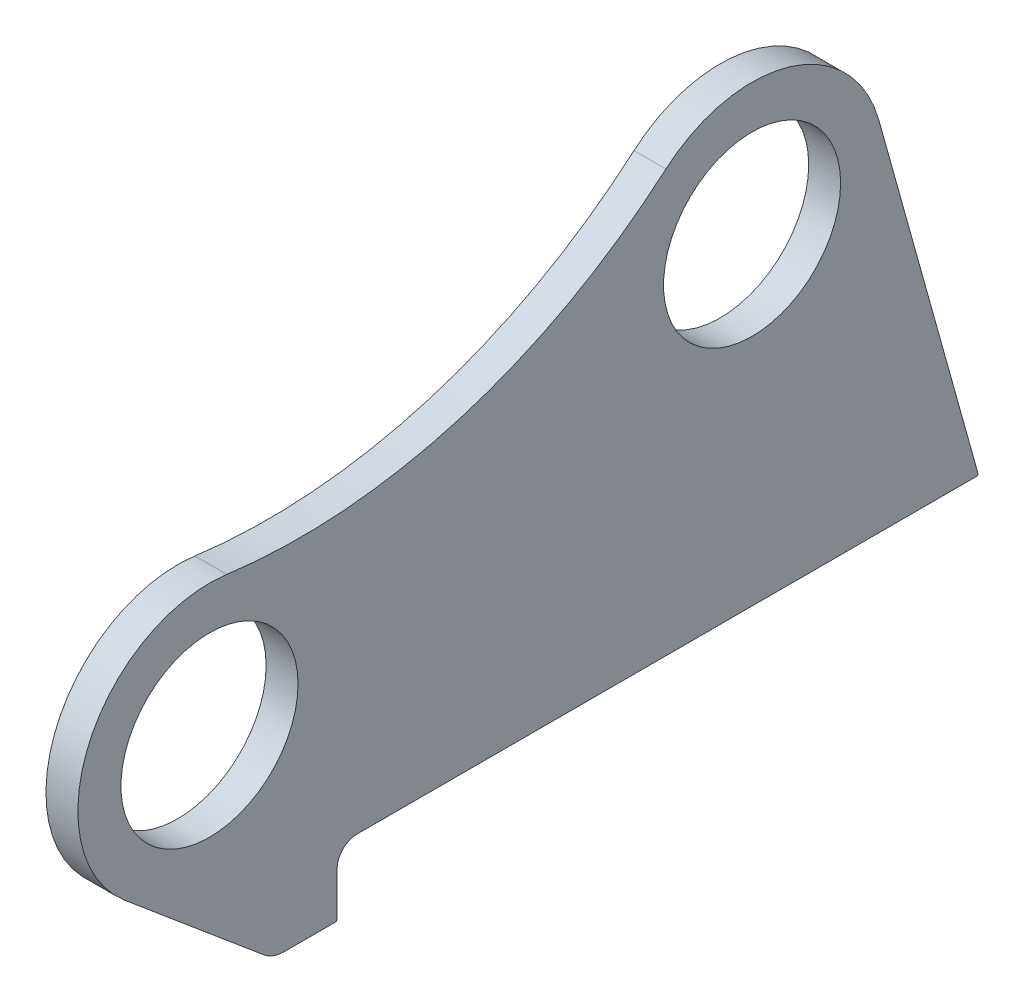
ISO-10303-21;
HEADER;
FILE_DESCRIPTION(('STEP AP214'),'2;1');
FILE_NAME('part.step','',(''),(''),'','','');
FILE_SCHEMA(('AUTOMOTIVE_DESIGN { 1 0 10303 214 1 1 1 1 }'));
ENDSEC;
DATA;
#1=APPLICATION_CONTEXT('core data for automotive mechanical design processes');
#2=APPLICATION_PROTOCOL_DEFINITION('international standard','automotive_design',2000,#1);
#3=PRODUCT_CONTEXT('',#1,'mechanical');
#4=PRODUCT('Part','Part','',(#3));
#5=PRODUCT_RELATED_PRODUCT_CATEGORY('part','',(#4));
#6=PRODUCT_DEFINITION_FORMATION('','',#4);
#7=PRODUCT_DEFINITION_CONTEXT('part definition',#1,'design');
#8=PRODUCT_DEFINITION('design','',#6,#7);
#9=PRODUCT_DEFINITION_SHAPE('','',#8);
#10=(LENGTH_UNIT() NAMED_UNIT(*) SI_UNIT(.MILLI.,.METRE.));
#11=(NAMED_UNIT(*) PLANE_ANGLE_UNIT() SI_UNIT($,.RADIAN.));
#12=(NAMED_UNIT(*) SI_UNIT($,.STERADIAN.) SOLID_ANGLE_UNIT());
#13=UNCERTAINTY_MEASURE_WITH_UNIT(LENGTH_MEASURE(1.E-05),#10,'distance_accuracy_value','');
#14=(GEOMETRIC_REPRESENTATION_CONTEXT(3) GLOBAL_UNCERTAINTY_ASSIGNED_CONTEXT((#13)) GLOBAL_UNIT_ASSIGNED_CONTEXT((#10,
#11,#12)) REPRESENTATION_CONTEXT('',''));
#15=CARTESIAN_POINT('',(0.,0.,0.));
#16=DIRECTION('',(0.,0.,1.));
#17=DIRECTION('',(1.,0.,0.));
#18=AXIS2_PLACEMENT_3D('',#15,#16,#17);
#19=CARTESIAN_POINT('',(-20.,528.745227809778,23.1336687455192));
#20=DIRECTION('',(1.,0.,0.));
#21=DIRECTION('',(0.,0.,-1.));
#22=AXIS2_PLACEMENT_3D('',#19,#20,#21);
#23=CYLINDRICAL_SURFACE('',#22,350.);
#24=CARTESIAN_POINT('',(0.,528.745227809778,23.1336687455192));
#25=DIRECTION('',(-1.,0.,0.));
#26=DIRECTION('',(0.,0.,-1.));
#27=AXIS2_PLACEMENT_3D('',#24,#25,#26);
#28=CIRCLE('',#27,350.);
#29=CARTESIAN_POINT('',(0.,264.217399055742,-206.049724663941));
#30=VERTEX_POINT('',#29);
#31=CARTESIAN_POINT('',(0.,181.783771778747,69.1526651364285));
#32=VERTEX_POINT('',#31);
#33=EDGE_CURVE('E178',#30,#32,#28,.T.);
#34=ORIENTED_EDGE('',*,*,#33,.F.);
#35=DIRECTION('',(1.,0.,0.));
#36=VECTOR('',#35,1.);
#37=CARTESIAN_POINT('',(-20.,264.217399055742,-206.049724663941));
#38=LINE('',#37,#36);
#39=CARTESIAN_POINT('',(-20.,264.217399055742,-206.049724663941));
#40=VERTEX_POINT('',#39);
#41=EDGE_CURVE('E151',#40,#30,#38,.T.);
#42=ORIENTED_EDGE('',*,*,#41,.F.);
#43=CARTESIAN_POINT('',(-20.,528.745227809778,23.1336687455192));
#44=DIRECTION('',(-1.,0.,0.));
#45=DIRECTION('',(0.,0.,-1.));
#46=AXIS2_PLACEMENT_3D('',#43,#44,#45);
#47=CIRCLE('',#46,350.);
#48=CARTESIAN_POINT('',(-20.,181.783771778747,69.1526651364285));
#49=VERTEX_POINT('',#48);
#50=EDGE_CURVE('E145',#40,#49,#47,.T.);
#51=ORIENTED_EDGE('',*,*,#50,.T.);
#52=DIRECTION('',(1.,0.,0.));
#53=VECTOR('',#52,1.);
#54=CARTESIAN_POINT('',(-20.,181.783771778747,69.1526651364285));
#55=LINE('',#54,#53);
#56=EDGE_CURVE('E127',#49,#32,#55,.T.);
#57=ORIENTED_EDGE('',*,*,#56,.T.);
#58=EDGE_LOOP('',(#34,#42,#51,#57));
#59=FACE_BOUND('',#58,.T.);
#60=ADVANCED_FACE('F38',(#59),#23,.F.);
#61=CARTESIAN_POINT('',(-20.,201.864410849434,-260.071524539028));
#62=DIRECTION('',(1.,0.,0.));
#63=DIRECTION('',(0.,0.,-1.));
#64=AXIS2_PLACEMENT_3D('',#61,#62,#63);
#65=CYLINDRICAL_SURFACE('',#64,82.5);
#66=CARTESIAN_POINT('',(0.,201.864410849434,-260.071524539028));
#67=DIRECTION('',(1.,0.,0.));
#68=DIRECTION('',(0.,0.,-1.));
#69=AXIS2_PLACEMENT_3D('',#66,#67,#68);
#70=CIRCLE('',#69,82.5);
#71=CARTESIAN_POINT('',(0.,224.021204370391,-339.5405531028));
#72=VERTEX_POINT('',#71);
#73=EDGE_CURVE('E152',#72,#30,#70,.T.);
#74=ORIENTED_EDGE('',*,*,#73,.F.);
#75=DIRECTION('',(1.,0.,0.));
#76=VECTOR('',#75,1.);
#77=CARTESIAN_POINT('',(-20.,224.021204370391,-339.5405531028));
#78=LINE('',#77,#76);
#79=CARTESIAN_POINT('',(-20.,224.021204370391,-339.5405531028));
#80=VERTEX_POINT('',#79);
#81=EDGE_CURVE('E202',#80,#72,#78,.T.);
#82=ORIENTED_EDGE('',*,*,#81,.F.);
#83=CARTESIAN_POINT('',(-20.,201.864410849434,-260.071524539028));
#84=DIRECTION('',(1.,0.,0.));
#85=DIRECTION('',(0.,0.,-1.));
#86=AXIS2_PLACEMENT_3D('',#83,#84,#85);
#87=CIRCLE('',#86,82.5);
#88=EDGE_CURVE('E138',#80,#40,#87,.T.);
#89=ORIENTED_EDGE('',*,*,#88,.T.);
#90=ORIENTED_EDGE('',*,*,#41,.T.);
#91=EDGE_LOOP('',(#74,#82,#89,#90));
#92=FACE_BOUND('',#91,.T.);
#93=ADVANCED_FACE('F243',(#92),#65,.T.);
#94=CARTESIAN_POINT('',(-20.,0.,-402.));
#95=DIRECTION('',(0.,0.268567194193426,-0.963260952288149));
#96=DIRECTION('',(0.,0.963260952288149,0.268567194193426));
#97=AXIS2_PLACEMENT_3D('',#94,#95,#96);
#98=PLANE('',#97);
#99=DIRECTION('',(0.,0.963260952288149,0.268567194193426));
#100=VECTOR('',#99,1.);
#101=CARTESIAN_POINT('',(0.,0.,-402.));
#102=LINE('',#101,#100);
#103=CARTESIAN_POINT('',(0.,1.26856719419344,-401.646310243158));
#104=VERTEX_POINT('',#103);
#105=EDGE_CURVE('E155',#104,#72,#102,.T.);
#106=ORIENTED_EDGE('',*,*,#105,.F.);
#107=DIRECTION('',(1.,0.,0.));
#108=VECTOR('',#107,1.);
#109=CARTESIAN_POINT('',(-20.,1.26856719419344,-401.646310243158));
#110=LINE('',#109,#108);
#111=CARTESIAN_POINT('',(-20.,1.26856719419344,-401.646310243158));
#112=VERTEX_POINT('',#111);
#113=EDGE_CURVE('E221',#104,#112,#110,.F.);
#114=ORIENTED_EDGE('',*,*,#113,.T.);
#115=DIRECTION('',(0.,0.963260952288149,0.268567194193426));
#116=VECTOR('',#115,1.);
#117=CARTESIAN_POINT('',(-20.,0.,-402.));
#118=LINE('',#117,#116);
#119=EDGE_CURVE('E175',#112,#80,#118,.T.);
#120=ORIENTED_EDGE('',*,*,#119,.T.);
#121=ORIENTED_EDGE('',*,*,#81,.T.);
#122=EDGE_LOOP('',(#106,#114,#120,#121));
#123=FACE_BOUND('',#122,.T.);
#124=ADVANCED_FACE('F269',(#123),#98,.T.);
#125=CARTESIAN_POINT('',(-20.,0.,-12.5));
#126=DIRECTION('',(0.,-1.,0.));
#127=DIRECTION('',(0.,0.,-1.));
#128=AXIS2_PLACEMENT_3D('',#125,#126,#127);
#129=PLANE('',#128);
#130=DIRECTION('',(0.,0.,-1.));
#131=VECTOR('',#130,1.);
#132=CARTESIAN_POINT('',(-20.,0.,-12.5));
#133=LINE('',#132,#131);
#134=CARTESIAN_POINT('',(-20.,0.,-12.5));
#135=VERTEX_POINT('',#134);
#136=CARTESIAN_POINT('',(-20.,0.,-400.68304929087));
#137=VERTEX_POINT('',#136);
#138=EDGE_CURVE('E172',#135,#137,#133,.T.);
#139=ORIENTED_EDGE('',*,*,#138,.T.);
#140=DIRECTION('',(1.,0.,0.));
#141=VECTOR('',#140,1.);
#142=CARTESIAN_POINT('',(-20.,0.,-400.68304929087));
#143=LINE('',#142,#141);
#144=CARTESIAN_POINT('',(0.,0.,-400.68304929087));
#145=VERTEX_POINT('',#144);
#146=EDGE_CURVE('E201',#137,#145,#143,.T.);
#147=ORIENTED_EDGE('',*,*,#146,.T.);
#148=DIRECTION('',(0.,0.,-1.));
#149=VECTOR('',#148,1.);
#150=CARTESIAN_POINT('',(0.,0.,-12.5));
#151=LINE('',#150,#149);
#152=CARTESIAN_POINT('',(0.,0.,-12.5));
#153=VERTEX_POINT('',#152);
#154=EDGE_CURVE('E196',#153,#145,#151,.T.);
#155=ORIENTED_EDGE('',*,*,#154,.F.);
#156=DIRECTION('',(1.,0.,0.));
#157=VECTOR('',#156,1.);
#158=CARTESIAN_POINT('',(-20.,0.,-12.5));
#159=LINE('',#158,#157);
#160=EDGE_CURVE('E205',#135,#153,#159,.T.);
#161=ORIENTED_EDGE('',*,*,#160,.F.);
#162=EDGE_LOOP('',(#139,#147,#155,#161));
#163=FACE_BOUND('',#162,.T.);
#164=ADVANCED_FACE('F253',(#163),#129,.T.);
#165=CARTESIAN_POINT('',(-20.,-12.5,-12.5));
#166=DIRECTION('',(1.,0.,0.));
#167=DIRECTION('',(0.,0.,-1.));
#168=AXIS2_PLACEMENT_3D('',#165,#166,#167);
#169=CYLINDRICAL_SURFACE('',#168,12.5);
#170=CARTESIAN_POINT('',(0.,-12.5,-12.5));
#171=DIRECTION('',(-1.,0.,0.));
#172=DIRECTION('',(0.,0.,1.));
#173=AXIS2_PLACEMENT_3D('',#170,#171,#172);
#174=CIRCLE('',#173,12.5);
#175=CARTESIAN_POINT('',(0.,-12.5,0.));
#176=VERTEX_POINT('',#175);
#177=EDGE_CURVE('E193',#176,#153,#174,.T.);
#178=ORIENTED_EDGE('',*,*,#177,.F.);
#179=DIRECTION('',(1.,0.,0.));
#180=VECTOR('',#179,1.);
#181=CARTESIAN_POINT('',(-20.,-12.5,0.));
#182=LINE('',#181,#180);
#183=CARTESIAN_POINT('',(-20.,-12.5,0.));
#184=VERTEX_POINT('',#183);
#185=EDGE_CURVE('E207',#184,#176,#182,.T.);
#186=ORIENTED_EDGE('',*,*,#185,.F.);
#187=CARTESIAN_POINT('',(-20.,-12.5,-12.5));
#188=DIRECTION('',(-1.,0.,0.));
#189=DIRECTION('',(0.,0.,1.));
#190=AXIS2_PLACEMENT_3D('',#187,#188,#189);
#191=CIRCLE('',#190,12.5);
#192=EDGE_CURVE('E169',#184,#135,#191,.T.);
#193=ORIENTED_EDGE('',*,*,#192,.T.);
#194=ORIENTED_EDGE('',*,*,#160,.T.);
#195=EDGE_LOOP('',(#178,#186,#193,#194));
#196=FACE_BOUND('',#195,.T.);
#197=ADVANCED_FACE('F257',(#196),#169,.F.);
#198=CARTESIAN_POINT('',(-20.,-41.,0.));
#199=DIRECTION('',(0.,0.,-1.));
#200=DIRECTION('',(-1.,0.,0.));
#201=AXIS2_PLACEMENT_3D('',#198,#199,#200);
#202=PLANE('',#201);
#203=DIRECTION('',(0.,1.,0.));
#204=VECTOR('',#203,1.);
#205=CARTESIAN_POINT('',(0.,-41.,0.));
#206=LINE('',#205,#204);
#207=CARTESIAN_POINT('',(0.,-40.,0.));
#208=VERTEX_POINT('',#207);
#209=EDGE_CURVE('E191',#208,#176,#206,.T.);
#210=ORIENTED_EDGE('',*,*,#209,.F.);
#211=DIRECTION('',(1.,0.,0.));
#212=VECTOR('',#211,1.);
#213=CARTESIAN_POINT('',(-20.,-40.,0.));
#214=LINE('',#213,#212);
#215=CARTESIAN_POINT('',(-20.,-40.,0.));
#216=VERTEX_POINT('',#215);
#217=EDGE_CURVE('E11',#208,#216,#214,.F.);
#218=ORIENTED_EDGE('',*,*,#217,.T.);
#219=DIRECTION('',(0.,1.,0.));
#220=VECTOR('',#219,1.);
#221=CARTESIAN_POINT('',(-20.,-41.,0.));
#222=LINE('',#221,#220);
#223=EDGE_CURVE('E167',#216,#184,#222,.T.);
#224=ORIENTED_EDGE('',*,*,#223,.T.);
#225=ORIENTED_EDGE('',*,*,#185,.T.);
#226=EDGE_LOOP('',(#210,#218,#224,#225));
#227=FACE_BOUND('',#226,.T.);
#228=ADVANCED_FACE('F280',(#227),#202,.T.);
#229=CARTESIAN_POINT('',(-20.,-41.,0.));
#230=DIRECTION('',(0.,-1.,0.));
#231=DIRECTION('',(0.,0.,-1.));
#232=AXIS2_PLACEMENT_3D('',#229,#230,#231);
#233=PLANE('',#232);
#234=DIRECTION('',(0.,0.,-1.));
#235=VECTOR('',#234,1.);
#236=CARTESIAN_POINT('',(-20.,-41.,0.));
#237=LINE('',#236,#235);
#238=CARTESIAN_POINT('',(-20.,-41.,33.1096120214944));
#239=VERTEX_POINT('',#238);
#240=CARTESIAN_POINT('',(-20.,-41.,1.));
#241=VERTEX_POINT('',#240);
#242=EDGE_CURVE('E165',#239,#241,#237,.T.);
#243=ORIENTED_EDGE('',*,*,#242,.T.);
#244=DIRECTION('',(1.,0.,0.));
#245=VECTOR('',#244,1.);
#246=CARTESIAN_POINT('',(-20.,-41.,1.));
#247=LINE('',#246,#245);
#248=CARTESIAN_POINT('',(0.,-41.,1.));
#249=VERTEX_POINT('',#248);
#250=EDGE_CURVE('E46',#241,#249,#247,.T.);
#251=ORIENTED_EDGE('',*,*,#250,.T.);
#252=DIRECTION('',(0.,0.,-1.));
#253=VECTOR('',#252,1.);
#254=CARTESIAN_POINT('',(0.,-41.,0.));
#255=LINE('',#254,#253);
#256=CARTESIAN_POINT('',(0.,-41.,33.1096120214944));
#257=VERTEX_POINT('',#256);
#258=EDGE_CURVE('E188',#257,#249,#255,.T.);
#259=ORIENTED_EDGE('',*,*,#258,.F.);
#260=DIRECTION('',(1.,0.,0.));
#261=VECTOR('',#260,1.);
#262=CARTESIAN_POINT('',(-20.,-41.,33.1096120214944));
#263=LINE('',#262,#261);
#264=EDGE_CURVE('E210',#239,#257,#263,.T.);
#265=ORIENTED_EDGE('',*,*,#264,.F.);
#266=EDGE_LOOP('',(#243,#251,#259,#265));
#267=FACE_BOUND('',#266,.T.);
#268=ADVANCED_FACE('F229',(#267),#233,.T.);
#269=CARTESIAN_POINT('',(-20.,-21.,33.1096120214943));
#270=DIRECTION('',(1.,0.,0.));
#271=DIRECTION('',(0.,0.,-1.));
#272=AXIS2_PLACEMENT_3D('',#269,#270,#271);
#273=CYLINDRICAL_SURFACE('',#272,20.);
#274=CARTESIAN_POINT('',(0.,-21.,33.1096120214943));
#275=DIRECTION('',(1.,0.,0.));
#276=DIRECTION('',(0.,0.,-1.));
#277=AXIS2_PLACEMENT_3D('',#274,#275,#276);
#278=CIRCLE('',#277,20.);
#279=CARTESIAN_POINT('',(0.,-36.3151421434658,45.972209781101));
#280=VERTEX_POINT('',#279);
#281=EDGE_CURVE('E185',#280,#257,#278,.T.);
#282=ORIENTED_EDGE('',*,*,#281,.F.);
#283=DIRECTION('',(1.,0.,0.));
#284=VECTOR('',#283,1.);
#285=CARTESIAN_POINT('',(-20.,-36.3151421434658,45.972209781101));
#286=LINE('',#285,#284);
#287=CARTESIAN_POINT('',(-20.,-36.3151421434658,45.972209781101));
#288=VERTEX_POINT('',#287);
#289=EDGE_CURVE('E212',#288,#280,#286,.T.);
#290=ORIENTED_EDGE('',*,*,#289,.F.);
#291=CARTESIAN_POINT('',(-20.,-21.,33.1096120214943));
#292=DIRECTION('',(1.,0.,0.));
#293=DIRECTION('',(0.,0.,-1.));
#294=AXIS2_PLACEMENT_3D('',#291,#292,#293);
#295=CIRCLE('',#294,20.);
#296=EDGE_CURVE('E162',#288,#239,#295,.T.);
#297=ORIENTED_EDGE('',*,*,#296,.T.);
#298=ORIENTED_EDGE('',*,*,#264,.T.);
#299=EDGE_LOOP('',(#282,#290,#297,#298));
#300=FACE_BOUND('',#299,.T.);
#301=ADVANCED_FACE('F236',(#300),#273,.T.);
#302=CARTESIAN_POINT('',(-20.,36.8250386582074,133.058215758378));
#303=DIRECTION('',(0.,-0.765757107173288,0.643129887980334));
#304=DIRECTION('',(0.,-0.643129887980334,-0.765757107173288));
#305=AXIS2_PLACEMENT_3D('',#302,#303,#304);
#306=PLANE('',#305);
#307=DIRECTION('',(0.,-0.643129887980334,-0.765757107173288));
#308=VECTOR('',#307,1.);
#309=CARTESIAN_POINT('',(0.,36.8250386582074,133.058215758378));
#310=LINE('',#309,#308);
#311=CARTESIAN_POINT('',(0.,36.8250386582073,133.058215758378));
#312=VERTEX_POINT('',#311);
#313=EDGE_CURVE('E182',#312,#280,#310,.T.);
#314=ORIENTED_EDGE('',*,*,#313,.F.);
#315=DIRECTION('',(1.,0.,0.));
#316=VECTOR('',#315,1.);
#317=CARTESIAN_POINT('',(-20.,36.8250386582073,133.058215758378));
#318=LINE('',#317,#316);
#319=CARTESIAN_POINT('',(-20.,36.8250386582073,133.058215758378));
#320=VERTEX_POINT('',#319);
#321=EDGE_CURVE('E137',#320,#312,#318,.T.);
#322=ORIENTED_EDGE('',*,*,#321,.F.);
#323=DIRECTION('',(0.,-0.643129887980334,-0.765757107173288));
#324=VECTOR('',#323,1.);
#325=CARTESIAN_POINT('',(-20.,36.8250386582074,133.058215758378));
#326=LINE('',#325,#324);
#327=EDGE_CURVE('E149',#320,#288,#326,.T.);
#328=ORIENTED_EDGE('',*,*,#327,.T.);
#329=ORIENTED_EDGE('',*,*,#289,.T.);
#330=EDGE_LOOP('',(#314,#322,#328,#329));
#331=FACE_BOUND('',#330,.T.);
#332=ADVANCED_FACE('F238',(#331),#306,.T.);
#333=CARTESIAN_POINT('',(-20.,100.000000000004,80.));
#334=DIRECTION('',(1.,0.,0.));
#335=DIRECTION('',(0.,0.,-1.));
#336=AXIS2_PLACEMENT_3D('',#333,#334,#335);
#337=CYLINDRICAL_SURFACE('',#336,82.5);
#338=CARTESIAN_POINT('',(0.,100.000000000004,80.));
#339=DIRECTION('',(1.,0.,0.));
#340=DIRECTION('',(0.,0.,-1.));
#341=AXIS2_PLACEMENT_3D('',#338,#339,#340);
#342=CIRCLE('',#341,82.5);
#343=EDGE_CURVE('E132',#32,#312,#342,.T.);
#344=ORIENTED_EDGE('',*,*,#343,.F.);
#345=ORIENTED_EDGE('',*,*,#56,.F.);
#346=CARTESIAN_POINT('',(-20.,100.000000000004,80.));
#347=DIRECTION('',(1.,0.,0.));
#348=DIRECTION('',(0.,0.,-1.));
#349=AXIS2_PLACEMENT_3D('',#346,#347,#348);
#350=CIRCLE('',#349,82.5);
#351=EDGE_CURVE('E130',#49,#320,#350,.T.);
#352=ORIENTED_EDGE('',*,*,#351,.T.);
#353=ORIENTED_EDGE('',*,*,#321,.T.);
#354=EDGE_LOOP('',(#344,#345,#352,#353));
#355=FACE_BOUND('',#354,.T.);
#356=ADVANCED_FACE('F129',(#355),#337,.T.);
#357=CARTESIAN_POINT('',(-20.,528.745227809778,23.1336687455192));
#358=DIRECTION('',(1.,0.,0.));
#359=DIRECTION('',(0.,0.,-1.));
#360=AXIS2_PLACEMENT_3D('',#357,#358,#359);
#361=PLANE('',#360);
#362=CARTESIAN_POINT('',(-20.,201.864410849434,-260.071524539028));
#363=DIRECTION('',(1.,0.,0.));
#364=DIRECTION('',(0.,0.,-1.));
#365=AXIS2_PLACEMENT_3D('',#362,#363,#364);
#366=CIRCLE('',#365,55.5);
#367=CARTESIAN_POINT('',(-20.,201.864410849434,-315.571524539028));
#368=VERTEX_POINT('',#367);
#369=EDGE_CURVE('E306',#368,#368,#366,.T.);
#370=ORIENTED_EDGE('',*,*,#369,.T.);
#371=EDGE_LOOP('',(#370));
#372=FACE_BOUND('',#371,.T.);
#373=CARTESIAN_POINT('',(-20.,100.000000000004,80.));
#374=DIRECTION('',(1.,0.,0.));
#375=DIRECTION('',(0.,0.,-1.));
#376=AXIS2_PLACEMENT_3D('',#373,#374,#375);
#377=CIRCLE('',#376,55.5);
#378=CARTESIAN_POINT('',(-20.,100.000000000004,24.5));
#379=VERTEX_POINT('',#378);
#380=EDGE_CURVE('E180',#379,#379,#377,.T.);
#381=ORIENTED_EDGE('',*,*,#380,.T.);
#382=EDGE_LOOP('',(#381));
#383=FACE_BOUND('',#382,.T.);
#384=ORIENTED_EDGE('',*,*,#119,.F.);
#385=CARTESIAN_POINT('',(-20.,1.,-400.68304929087));
#386=DIRECTION('',(1.,0.,0.));
#387=DIRECTION('',(0.,0.,-1.));
#388=AXIS2_PLACEMENT_3D('',#385,#386,#387);
#389=CIRCLE('',#388,1.);
#390=EDGE_CURVE('E224',#112,#137,#389,.F.);
#391=ORIENTED_EDGE('',*,*,#390,.T.);
#392=ORIENTED_EDGE('',*,*,#138,.F.);
#393=ORIENTED_EDGE('',*,*,#192,.F.);
#394=ORIENTED_EDGE('',*,*,#223,.F.);
#395=CARTESIAN_POINT('',(-20.,-40.,1.));
#396=DIRECTION('',(1.,0.,0.));
#397=DIRECTION('',(0.,0.,-1.));
#398=AXIS2_PLACEMENT_3D('',#395,#396,#397);
#399=CIRCLE('',#398,1.);
#400=EDGE_CURVE('E53',#216,#241,#399,.F.);
#401=ORIENTED_EDGE('',*,*,#400,.T.);
#402=ORIENTED_EDGE('',*,*,#242,.F.);
#403=ORIENTED_EDGE('',*,*,#296,.F.);
#404=ORIENTED_EDGE('',*,*,#327,.F.);
#405=ORIENTED_EDGE('',*,*,#351,.F.);
#406=ORIENTED_EDGE('',*,*,#50,.F.);
#407=ORIENTED_EDGE('',*,*,#88,.F.);
#408=EDGE_LOOP('',(#384,#391,#392,#393,#394,#401,#402,#403,#404,#405,#406,#407));
#409=FACE_BOUND('',#408,.T.);
#410=ADVANCED_FACE('F143',(#372,#383,#409),#361,.F.);
#411=CARTESIAN_POINT('',(0.,528.745227809778,23.1336687455192));
#412=DIRECTION('',(1.,0.,0.));
#413=DIRECTION('',(0.,0.,-1.));
#414=AXIS2_PLACEMENT_3D('',#411,#412,#413);
#415=PLANE('',#414);
#416=CARTESIAN_POINT('',(0.,201.864410849434,-260.071524539028));
#417=DIRECTION('',(1.,0.,0.));
#418=DIRECTION('',(0.,0.,-1.));
#419=AXIS2_PLACEMENT_3D('',#416,#417,#418);
#420=CIRCLE('',#419,55.5);
#421=CARTESIAN_POINT('',(0.,201.864410849434,-315.571524539028));
#422=VERTEX_POINT('',#421);
#423=EDGE_CURVE('E309',#422,#422,#420,.T.);
#424=ORIENTED_EDGE('',*,*,#423,.F.);
#425=EDGE_LOOP('',(#424));
#426=FACE_BOUND('',#425,.T.);
#427=CARTESIAN_POINT('',(0.,100.000000000004,80.));
#428=DIRECTION('',(1.,0.,0.));
#429=DIRECTION('',(0.,0.,-1.));
#430=AXIS2_PLACEMENT_3D('',#427,#428,#429);
#431=CIRCLE('',#430,55.5);
#432=CARTESIAN_POINT('',(0.,100.000000000004,24.5));
#433=VERTEX_POINT('',#432);
#434=EDGE_CURVE('E158',#433,#433,#431,.T.);
#435=ORIENTED_EDGE('',*,*,#434,.F.);
#436=EDGE_LOOP('',(#435));
#437=FACE_BOUND('',#436,.T.);
#438=ORIENTED_EDGE('',*,*,#154,.T.);
#439=CARTESIAN_POINT('',(0.,1.,-400.68304929087));
#440=DIRECTION('',(1.,0.,0.));
#441=DIRECTION('',(0.,0.,-1.));
#442=AXIS2_PLACEMENT_3D('',#439,#440,#441);
#443=CIRCLE('',#442,1.);
#444=EDGE_CURVE('E219',#145,#104,#443,.T.);
#445=ORIENTED_EDGE('',*,*,#444,.T.);
#446=ORIENTED_EDGE('',*,*,#105,.T.);
#447=ORIENTED_EDGE('',*,*,#73,.T.);
#448=ORIENTED_EDGE('',*,*,#33,.T.);
#449=ORIENTED_EDGE('',*,*,#343,.T.);
#450=ORIENTED_EDGE('',*,*,#313,.T.);
#451=ORIENTED_EDGE('',*,*,#281,.T.);
#452=ORIENTED_EDGE('',*,*,#258,.T.);
#453=CARTESIAN_POINT('',(0.,-40.,1.));
#454=DIRECTION('',(1.,0.,0.));
#455=DIRECTION('',(0.,0.,-1.));
#456=AXIS2_PLACEMENT_3D('',#453,#454,#455);
#457=CIRCLE('',#456,1.);
#458=EDGE_CURVE('E217',#249,#208,#457,.T.);
#459=ORIENTED_EDGE('',*,*,#458,.T.);
#460=ORIENTED_EDGE('',*,*,#209,.T.);
#461=ORIENTED_EDGE('',*,*,#177,.T.);
#462=EDGE_LOOP('',(#438,#445,#446,#447,#448,#449,#450,#451,#452,#459,#460,#461));
#463=FACE_BOUND('',#462,.T.);
#464=ADVANCED_FACE('F232',(#426,#437,#463),#415,.T.);
#465=CARTESIAN_POINT('',(-20.,100.000000000004,80.));
#466=DIRECTION('',(1.,0.,0.));
#467=DIRECTION('',(0.,0.,-1.));
#468=AXIS2_PLACEMENT_3D('',#465,#466,#467);
#469=CYLINDRICAL_SURFACE('',#468,55.5);
#470=ORIENTED_EDGE('',*,*,#380,.F.);
#471=EDGE_LOOP('',(#470));
#472=FACE_BOUND('',#471,.T.);
#473=ORIENTED_EDGE('',*,*,#434,.T.);
#474=EDGE_LOOP('',(#473));
#475=FACE_BOUND('',#474,.T.);
#476=ADVANCED_FACE('F291',(#472,#475),#469,.F.);
#477=CARTESIAN_POINT('',(-20.,201.864410849434,-260.071524539028));
#478=DIRECTION('',(1.,0.,0.));
#479=DIRECTION('',(0.,0.,-1.));
#480=AXIS2_PLACEMENT_3D('',#477,#478,#479);
#481=CYLINDRICAL_SURFACE('',#480,55.5);
#482=ORIENTED_EDGE('',*,*,#369,.F.);
#483=EDGE_LOOP('',(#482));
#484=FACE_BOUND('',#483,.T.);
#485=ORIENTED_EDGE('',*,*,#423,.T.);
#486=EDGE_LOOP('',(#485));
#487=FACE_BOUND('',#486,.T.);
#488=ADVANCED_FACE('F263',(#484,#487),#481,.F.);
#489=CARTESIAN_POINT('',(-20.,1.,-400.68304929087));
#490=DIRECTION('',(1.,0.,0.));
#491=DIRECTION('',(0.,0.,-1.));
#492=AXIS2_PLACEMENT_3D('',#489,#490,#491);
#493=CYLINDRICAL_SURFACE('',#492,1.);
#494=ORIENTED_EDGE('',*,*,#390,.F.);
#495=ORIENTED_EDGE('',*,*,#113,.F.);
#496=ORIENTED_EDGE('',*,*,#444,.F.);
#497=ORIENTED_EDGE('',*,*,#146,.F.);
#498=EDGE_LOOP('',(#494,#495,#496,#497));
#499=FACE_BOUND('',#498,.T.);
#500=ADVANCED_FACE('F250',(#499),#493,.T.);
#501=CARTESIAN_POINT('',(-20.,-40.,1.));
#502=DIRECTION('',(1.,0.,0.));
#503=DIRECTION('',(0.,0.,-1.));
#504=AXIS2_PLACEMENT_3D('',#501,#502,#503);
#505=CYLINDRICAL_SURFACE('',#504,1.);
#506=ORIENTED_EDGE('',*,*,#400,.F.);
#507=ORIENTED_EDGE('',*,*,#217,.F.);
#508=ORIENTED_EDGE('',*,*,#458,.F.);
#509=ORIENTED_EDGE('',*,*,#250,.F.);
#510=EDGE_LOOP('',(#506,#507,#508,#509));
#511=FACE_BOUND('',#510,.T.);
#512=ADVANCED_FACE('F40',(#511),#505,.T.);
#513=CLOSED_SHELL('',(#60,#93,#124,#164,#197,#228,#268,#301,#332,#356,#410,#464,#476,#488,#500,#512));
#514=MANIFOLD_SOLID_BREP('B2',#513);
#515=ADVANCED_BREP_SHAPE_REPRESENTATION('',(#18,#514),#14);
#516=SHAPE_DEFINITION_REPRESENTATION(#9,#515);
ENDSEC;
END-ISO-10303-21;
